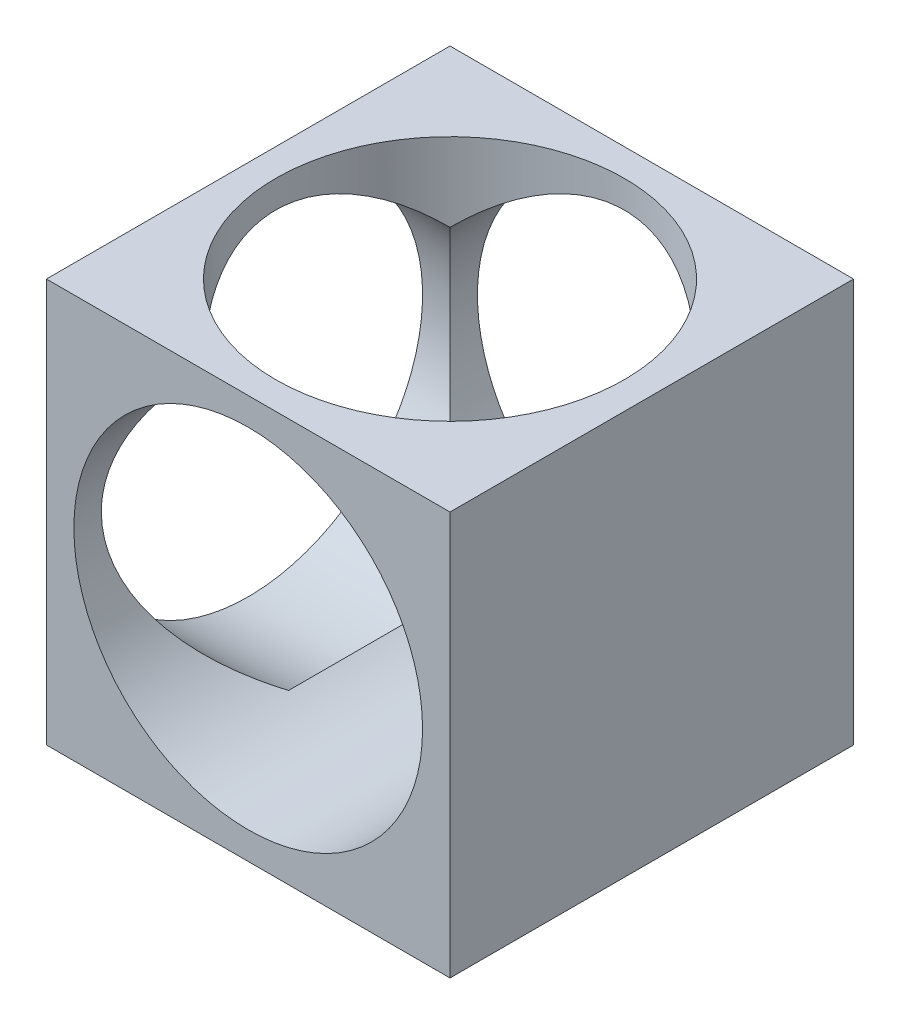
ISO-10303-21;
HEADER;
FILE_DESCRIPTION(('STEP AP214'),'2;1');
FILE_NAME('part.step','',(''),(''),'','','');
FILE_SCHEMA(('AUTOMOTIVE_DESIGN { 1 0 10303 214 1 1 1 1 }'));
ENDSEC;
DATA;
#1=APPLICATION_CONTEXT('core data for automotive mechanical design processes');
#2=APPLICATION_PROTOCOL_DEFINITION('international standard','automotive_design',2000,#1);
#3=PRODUCT_CONTEXT('',#1,'mechanical');
#4=PRODUCT('Part','Part','',(#3));
#5=PRODUCT_RELATED_PRODUCT_CATEGORY('part','',(#4));
#6=PRODUCT_DEFINITION_FORMATION('','',#4);
#7=PRODUCT_DEFINITION_CONTEXT('part definition',#1,'design');
#8=PRODUCT_DEFINITION('design','',#6,#7);
#9=PRODUCT_DEFINITION_SHAPE('','',#8);
#10=(LENGTH_UNIT() NAMED_UNIT(*) SI_UNIT(.MILLI.,.METRE.));
#11=(NAMED_UNIT(*) PLANE_ANGLE_UNIT() SI_UNIT($,.RADIAN.));
#12=(NAMED_UNIT(*) SI_UNIT($,.STERADIAN.) SOLID_ANGLE_UNIT());
#13=UNCERTAINTY_MEASURE_WITH_UNIT(LENGTH_MEASURE(1.E-05),#10,'distance_accuracy_value','');
#14=(GEOMETRIC_REPRESENTATION_CONTEXT(3) GLOBAL_UNCERTAINTY_ASSIGNED_CONTEXT((#13)) GLOBAL_UNIT_ASSIGNED_CONTEXT((#10,
#11,#12)) REPRESENTATION_CONTEXT('',''));
#15=CARTESIAN_POINT('',(0.,0.,0.));
#16=DIRECTION('',(0.,0.,1.));
#17=DIRECTION('',(1.,0.,0.));
#18=AXIS2_PLACEMENT_3D('',#15,#16,#17);
#19=CARTESIAN_POINT('',(0.,15.875,-15.875));
#20=DIRECTION('',(0.,0.,1.));
#21=DIRECTION('',(1.,0.,0.));
#22=AXIS2_PLACEMENT_3D('',#19,#20,#21);
#23=CYLINDRICAL_SURFACE('',#22,13.716);
#24=CARTESIAN_POINT('',(0.,15.875,15.875));
#25=DIRECTION('',(0.,0.,-1.));
#26=DIRECTION('',(-1.,0.,0.));
#27=AXIS2_PLACEMENT_3D('',#24,#25,#26);
#28=CIRCLE('',#27,13.716);
#29=CARTESIAN_POINT('',(-13.716,15.875,15.875));
#30=VERTEX_POINT('',#29);
#31=EDGE_CURVE('E138',#30,#30,#28,.T.);
#32=ORIENTED_EDGE('',*,*,#31,.F.);
#33=EDGE_LOOP('',(#32));
#34=FACE_BOUND('',#33,.T.);
#35=CARTESIAN_POINT('',(0.,15.875,-15.875));
#36=DIRECTION('',(0.,0.,1.));
#37=DIRECTION('',(1.,0.,0.));
#38=AXIS2_PLACEMENT_3D('',#35,#36,#37);
#39=CIRCLE('',#38,13.716);
#40=CARTESIAN_POINT('',(13.716,15.875,-15.875));
#41=VERTEX_POINT('',#40);
#42=EDGE_CURVE('E131',#41,#41,#39,.T.);
#43=ORIENTED_EDGE('',*,*,#42,.F.);
#44=EDGE_LOOP('',(#43));
#45=FACE_BOUND('',#44,.T.);
#46=DIRECTION('',(0.,0.,1.));
#47=VECTOR('',#46,1.);
#48=CARTESIAN_POINT('',(10.9537039854106,24.13,-15.875));
#49=LINE('',#48,#47);
#50=CARTESIAN_POINT('',(10.9537039854106,24.13,-8.255));
#51=VERTEX_POINT('',#50);
#52=CARTESIAN_POINT('',(10.9537039854106,24.13,8.255));
#53=VERTEX_POINT('',#52);
#54=EDGE_CURVE('E11',#51,#53,#49,.T.);
#55=ORIENTED_EDGE('',*,*,#54,.F.);
#56=CARTESIAN_POINT('',(0.,15.875,0.));
#57=DIRECTION('',(0.,0.707106781186547,0.707106781186547));
#58=DIRECTION('',(0.,-0.707106781186547,0.707106781186547));
#59=AXIS2_PLACEMENT_3D('',#56,#57,#58);
#60=ELLIPSE('',#59,19.3973532215094,13.716);
#61=CARTESIAN_POINT('',(-9.69867661075469,25.5736766107547,-9.69867661075468));
#62=VERTEX_POINT('',#61);
#63=EDGE_CURVE('E113',#51,#62,#60,.T.);
#64=ORIENTED_EDGE('',*,*,#63,.T.);
#65=CARTESIAN_POINT('',(0.,15.875,0.));
#66=DIRECTION('',(-0.707106781186547,0.,0.707106781186548));
#67=DIRECTION('',(0.707106781186547,0.,0.707106781186548));
#68=AXIS2_PLACEMENT_3D('',#65,#66,#67);
#69=ELLIPSE('',#68,19.3973532215094,13.716);
#70=CARTESIAN_POINT('',(-6.35,3.71744448912529,-6.35));
#71=VERTEX_POINT('',#70);
#72=EDGE_CURVE('E179',#62,#71,#69,.T.);
#73=ORIENTED_EDGE('',*,*,#72,.T.);
#74=DIRECTION('',(0.,0.,1.));
#75=VECTOR('',#74,1.);
#76=CARTESIAN_POINT('',(-6.35,3.71744448912529,-15.875));
#77=LINE('',#76,#75);
#78=CARTESIAN_POINT('',(-6.35,3.71744448912529,6.35));
#79=VERTEX_POINT('',#78);
#80=EDGE_CURVE('E182',#79,#71,#77,.F.);
#81=ORIENTED_EDGE('',*,*,#80,.F.);
#82=CARTESIAN_POINT('',(0.,15.875,0.));
#83=DIRECTION('',(0.707106781186547,0.,0.707106781186548));
#84=DIRECTION('',(-0.707106781186547,0.,0.707106781186548));
#85=AXIS2_PLACEMENT_3D('',#82,#83,#84);
#86=ELLIPSE('',#85,19.3973532215094,13.716);
#87=CARTESIAN_POINT('',(-9.69867661075469,25.5736766107547,9.69867661075469));
#88=VERTEX_POINT('',#87);
#89=EDGE_CURVE('E119',#79,#88,#86,.F.);
#90=ORIENTED_EDGE('',*,*,#89,.T.);
#91=CARTESIAN_POINT('',(0.,15.875,0.));
#92=DIRECTION('',(0.,-0.707106781186547,0.707106781186547));
#93=DIRECTION('',(0.,0.707106781186547,0.707106781186547));
#94=AXIS2_PLACEMENT_3D('',#91,#92,#93);
#95=ELLIPSE('',#94,19.3973532215094,13.716);
#96=EDGE_CURVE('E54',#88,#53,#95,.F.);
#97=ORIENTED_EDGE('',*,*,#96,.T.);
#98=EDGE_LOOP('',(#55,#64,#73,#81,#90,#97));
#99=FACE_BOUND('',#98,.T.);
#100=ADVANCED_FACE('F38',(#34,#45,#99),#23,.F.);
#101=CARTESIAN_POINT('',(15.875,31.75,15.875));
#102=DIRECTION('',(-1.,0.,0.));
#103=DIRECTION('',(0.,0.,1.));
#104=AXIS2_PLACEMENT_3D('',#101,#102,#103);
#105=PLANE('',#104);
#106=DIRECTION('',(0.,0.,-1.));
#107=VECTOR('',#106,1.);
#108=CARTESIAN_POINT('',(15.875,0.,15.875));
#109=LINE('',#108,#107);
#110=CARTESIAN_POINT('',(15.875,0.,15.875));
#111=VERTEX_POINT('',#110);
#112=CARTESIAN_POINT('',(15.875,0.,-15.875));
#113=VERTEX_POINT('',#112);
#114=EDGE_CURVE('E150',#111,#113,#109,.T.);
#115=ORIENTED_EDGE('',*,*,#114,.T.);
#116=DIRECTION('',(0.,-1.,0.));
#117=VECTOR('',#116,1.);
#118=CARTESIAN_POINT('',(15.875,31.75,-15.875));
#119=LINE('',#118,#117);
#120=CARTESIAN_POINT('',(15.875,31.75,-15.875));
#121=VERTEX_POINT('',#120);
#122=EDGE_CURVE('E171',#121,#113,#119,.T.);
#123=ORIENTED_EDGE('',*,*,#122,.F.);
#124=DIRECTION('',(0.,0.,-1.));
#125=VECTOR('',#124,1.);
#126=CARTESIAN_POINT('',(15.875,31.75,15.875));
#127=LINE('',#126,#125);
#128=CARTESIAN_POINT('',(15.875,31.75,15.875));
#129=VERTEX_POINT('',#128);
#130=EDGE_CURVE('E139',#129,#121,#127,.T.);
#131=ORIENTED_EDGE('',*,*,#130,.F.);
#132=DIRECTION('',(0.,-1.,0.));
#133=VECTOR('',#132,1.);
#134=CARTESIAN_POINT('',(15.875,31.75,15.875));
#135=LINE('',#134,#133);
#136=EDGE_CURVE('E149',#129,#111,#135,.T.);
#137=ORIENTED_EDGE('',*,*,#136,.T.);
#138=EDGE_LOOP('',(#115,#123,#131,#137));
#139=FACE_BOUND('',#138,.T.);
#140=ADVANCED_FACE('F40',(#139),#105,.F.);
#141=CARTESIAN_POINT('',(-15.875,31.75,-15.875));
#142=DIRECTION('',(0.,0.,1.));
#143=DIRECTION('',(1.,0.,0.));
#144=AXIS2_PLACEMENT_3D('',#141,#142,#143);
#145=PLANE('',#144);
#146=ORIENTED_EDGE('',*,*,#42,.T.);
#147=EDGE_LOOP('',(#146));
#148=FACE_BOUND('',#147,.T.);
#149=DIRECTION('',(-1.,0.,0.));
#150=VECTOR('',#149,1.);
#151=CARTESIAN_POINT('',(-15.875,0.,-15.875));
#152=LINE('',#151,#150);
#153=CARTESIAN_POINT('',(-15.875,0.,-15.875));
#154=VERTEX_POINT('',#153);
#155=EDGE_CURVE('E154',#113,#154,#152,.T.);
#156=ORIENTED_EDGE('',*,*,#155,.T.);
#157=DIRECTION('',(0.,-1.,0.));
#158=VECTOR('',#157,1.);
#159=CARTESIAN_POINT('',(-15.875,31.75,-15.875));
#160=LINE('',#159,#158);
#161=CARTESIAN_POINT('',(-15.875,31.75,-15.875));
#162=VERTEX_POINT('',#161);
#163=EDGE_CURVE('E167',#162,#154,#160,.T.);
#164=ORIENTED_EDGE('',*,*,#163,.F.);
#165=DIRECTION('',(-1.,0.,0.));
#166=VECTOR('',#165,1.);
#167=CARTESIAN_POINT('',(-15.875,31.75,-15.875));
#168=LINE('',#167,#166);
#169=EDGE_CURVE('E92',#121,#162,#168,.T.);
#170=ORIENTED_EDGE('',*,*,#169,.F.);
#171=ORIENTED_EDGE('',*,*,#122,.T.);
#172=EDGE_LOOP('',(#156,#164,#170,#171));
#173=FACE_BOUND('',#172,.T.);
#174=ADVANCED_FACE('F211',(#148,#173),#145,.F.);
#175=CARTESIAN_POINT('',(-15.875,31.75,15.875));
#176=DIRECTION('',(1.,0.,0.));
#177=DIRECTION('',(0.,0.,-1.));
#178=AXIS2_PLACEMENT_3D('',#175,#176,#177);
#179=PLANE('',#178);
#180=CARTESIAN_POINT('',(-15.875,15.875,0.));
#181=DIRECTION('',(-1.,0.,0.));
#182=DIRECTION('',(0.,0.,1.));
#183=AXIS2_PLACEMENT_3D('',#180,#181,#182);
#184=CIRCLE('',#183,13.716);
#185=CARTESIAN_POINT('',(-15.875,15.875,13.716));
#186=VERTEX_POINT('',#185);
#187=EDGE_CURVE('E123',#186,#186,#184,.T.);
#188=ORIENTED_EDGE('',*,*,#187,.F.);
#189=EDGE_LOOP('',(#188));
#190=FACE_BOUND('',#189,.T.);
#191=DIRECTION('',(0.,0.,1.));
#192=VECTOR('',#191,1.);
#193=CARTESIAN_POINT('',(-15.875,0.,15.875));
#194=LINE('',#193,#192);
#195=CARTESIAN_POINT('',(-15.875,0.,15.875));
#196=VERTEX_POINT('',#195);
#197=EDGE_CURVE('E157',#154,#196,#194,.T.);
#198=ORIENTED_EDGE('',*,*,#197,.T.);
#199=DIRECTION('',(0.,-1.,0.));
#200=VECTOR('',#199,1.);
#201=CARTESIAN_POINT('',(-15.875,31.75,15.875));
#202=LINE('',#201,#200);
#203=CARTESIAN_POINT('',(-15.875,31.75,15.875));
#204=VERTEX_POINT('',#203);
#205=EDGE_CURVE('E164',#204,#196,#202,.T.);
#206=ORIENTED_EDGE('',*,*,#205,.F.);
#207=DIRECTION('',(0.,0.,1.));
#208=VECTOR('',#207,1.);
#209=CARTESIAN_POINT('',(-15.875,31.75,15.875));
#210=LINE('',#209,#208);
#211=EDGE_CURVE('E144',#162,#204,#210,.T.);
#212=ORIENTED_EDGE('',*,*,#211,.F.);
#213=ORIENTED_EDGE('',*,*,#163,.T.);
#214=EDGE_LOOP('',(#198,#206,#212,#213));
#215=FACE_BOUND('',#214,.T.);
#216=ADVANCED_FACE('F225',(#190,#215),#179,.F.);
#217=CARTESIAN_POINT('',(-15.875,31.75,15.875));
#218=DIRECTION('',(0.,0.,-1.));
#219=DIRECTION('',(-1.,0.,0.));
#220=AXIS2_PLACEMENT_3D('',#217,#218,#219);
#221=PLANE('',#220);
#222=ORIENTED_EDGE('',*,*,#31,.T.);
#223=EDGE_LOOP('',(#222));
#224=FACE_BOUND('',#223,.T.);
#225=DIRECTION('',(1.,0.,0.));
#226=VECTOR('',#225,1.);
#227=CARTESIAN_POINT('',(-15.875,0.,15.875));
#228=LINE('',#227,#226);
#229=EDGE_CURVE('E84',#196,#111,#228,.T.);
#230=ORIENTED_EDGE('',*,*,#229,.T.);
#231=ORIENTED_EDGE('',*,*,#136,.F.);
#232=DIRECTION('',(1.,0.,0.));
#233=VECTOR('',#232,1.);
#234=CARTESIAN_POINT('',(-15.875,31.75,15.875));
#235=LINE('',#234,#233);
#236=EDGE_CURVE('E63',#204,#129,#235,.T.);
#237=ORIENTED_EDGE('',*,*,#236,.F.);
#238=ORIENTED_EDGE('',*,*,#205,.T.);
#239=EDGE_LOOP('',(#230,#231,#237,#238));
#240=FACE_BOUND('',#239,.T.);
#241=ADVANCED_FACE('F218',(#224,#240),#221,.F.);
#242=CARTESIAN_POINT('',(0.,31.75,0.));
#243=DIRECTION('',(0.,-1.,0.));
#244=DIRECTION('',(0.,0.,-1.));
#245=AXIS2_PLACEMENT_3D('',#242,#243,#244);
#246=PLANE('',#245);
#247=CARTESIAN_POINT('',(0.,31.75,0.));
#248=DIRECTION('',(0.,1.,0.));
#249=DIRECTION('',(0.,0.,1.));
#250=AXIS2_PLACEMENT_3D('',#247,#248,#249);
#251=CIRCLE('',#250,13.716);
#252=CARTESIAN_POINT('',(0.,31.75,13.716));
#253=VERTEX_POINT('',#252);
#254=EDGE_CURVE('E115',#253,#253,#251,.T.);
#255=ORIENTED_EDGE('',*,*,#254,.F.);
#256=EDGE_LOOP('',(#255));
#257=FACE_BOUND('',#256,.T.);
#258=ORIENTED_EDGE('',*,*,#130,.T.);
#259=ORIENTED_EDGE('',*,*,#169,.T.);
#260=ORIENTED_EDGE('',*,*,#211,.T.);
#261=ORIENTED_EDGE('',*,*,#236,.T.);
#262=EDGE_LOOP('',(#258,#259,#260,#261));
#263=FACE_BOUND('',#262,.T.);
#264=ADVANCED_FACE('F216',(#257,#263),#246,.F.);
#265=CARTESIAN_POINT('',(0.,0.,0.));
#266=DIRECTION('',(0.,-1.,0.));
#267=DIRECTION('',(0.,0.,-1.));
#268=AXIS2_PLACEMENT_3D('',#265,#266,#267);
#269=PLANE('',#268);
#270=ORIENTED_EDGE('',*,*,#114,.F.);
#271=ORIENTED_EDGE('',*,*,#229,.F.);
#272=ORIENTED_EDGE('',*,*,#197,.F.);
#273=ORIENTED_EDGE('',*,*,#155,.F.);
#274=EDGE_LOOP('',(#270,#271,#272,#273));
#275=FACE_BOUND('',#274,.T.);
#276=ADVANCED_FACE('F200',(#275),#269,.T.);
#277=CARTESIAN_POINT('',(-6.35,15.875,0.));
#278=DIRECTION('',(-1.,0.,0.));
#279=DIRECTION('',(0.,0.,1.));
#280=AXIS2_PLACEMENT_3D('',#277,#278,#279);
#281=CYLINDRICAL_SURFACE('',#280,13.716);
#282=ORIENTED_EDGE('',*,*,#187,.T.);
#283=EDGE_LOOP('',(#282));
#284=FACE_BOUND('',#283,.T.);
#285=ORIENTED_EDGE('',*,*,#72,.F.);
#286=CARTESIAN_POINT('',(0.,15.875,0.));
#287=DIRECTION('',(-0.707106781186547,-0.707106781186548,0.));
#288=DIRECTION('',(-0.707106781186547,0.707106781186548,0.));
#289=AXIS2_PLACEMENT_3D('',#286,#287,#288);
#290=ELLIPSE('',#289,19.3973532215094,13.716);
#291=EDGE_CURVE('E47',#62,#88,#290,.F.);
#292=ORIENTED_EDGE('',*,*,#291,.T.);
#293=ORIENTED_EDGE('',*,*,#89,.F.);
#294=CARTESIAN_POINT('',(-6.35,15.875,0.));
#295=DIRECTION('',(-1.,0.,0.));
#296=DIRECTION('',(0.,0.,1.));
#297=AXIS2_PLACEMENT_3D('',#294,#295,#296);
#298=CIRCLE('',#297,13.716);
#299=EDGE_CURVE('E127',#71,#79,#298,.T.);
#300=ORIENTED_EDGE('',*,*,#299,.F.);
#301=EDGE_LOOP('',(#285,#292,#293,#300));
#302=FACE_BOUND('',#301,.T.);
#303=ADVANCED_FACE('F188',(#284,#302),#281,.F.);
#304=CARTESIAN_POINT('',(-6.35,15.875,0.));
#305=DIRECTION('',(-1.,0.,0.));
#306=DIRECTION('',(0.,0.,1.));
#307=AXIS2_PLACEMENT_3D('',#304,#305,#306);
#308=PLANE('',#307);
#309=ORIENTED_EDGE('',*,*,#80,.T.);
#310=ORIENTED_EDGE('',*,*,#299,.T.);
#311=EDGE_LOOP('',(#309,#310));
#312=FACE_BOUND('',#311,.T.);
#313=ADVANCED_FACE('F191',(#312),#308,.T.);
#314=CARTESIAN_POINT('',(0.,24.13,0.));
#315=DIRECTION('',(0.,1.,0.));
#316=DIRECTION('',(0.,0.,1.));
#317=AXIS2_PLACEMENT_3D('',#314,#315,#316);
#318=PLANE('',#317);
#319=ORIENTED_EDGE('',*,*,#54,.T.);
#320=CARTESIAN_POINT('',(0.,24.13,0.));
#321=DIRECTION('',(0.,1.,0.));
#322=DIRECTION('',(0.,0.,1.));
#323=AXIS2_PLACEMENT_3D('',#320,#321,#322);
#324=CIRCLE('',#323,13.716);
#325=EDGE_CURVE('E109',#53,#51,#324,.T.);
#326=ORIENTED_EDGE('',*,*,#325,.T.);
#327=EDGE_LOOP('',(#319,#326));
#328=FACE_BOUND('',#327,.T.);
#329=ADVANCED_FACE('F108',(#328),#318,.T.);
#330=CARTESIAN_POINT('',(0.,24.13,0.));
#331=DIRECTION('',(0.,1.,0.));
#332=DIRECTION('',(0.,0.,1.));
#333=AXIS2_PLACEMENT_3D('',#330,#331,#332);
#334=CYLINDRICAL_SURFACE('',#333,13.716);
#335=ORIENTED_EDGE('',*,*,#254,.T.);
#336=EDGE_LOOP('',(#335));
#337=FACE_BOUND('',#336,.T.);
#338=ORIENTED_EDGE('',*,*,#325,.F.);
#339=ORIENTED_EDGE('',*,*,#96,.F.);
#340=ORIENTED_EDGE('',*,*,#291,.F.);
#341=ORIENTED_EDGE('',*,*,#63,.F.);
#342=EDGE_LOOP('',(#338,#339,#340,#341));
#343=FACE_BOUND('',#342,.T.);
#344=ADVANCED_FACE('F112',(#337,#343),#334,.F.);
#345=CLOSED_SHELL('',(#100,#140,#174,#216,#241,#264,#276,#303,#313,#329,#344));
#346=MANIFOLD_SOLID_BREP('B2',#345);
#347=ADVANCED_BREP_SHAPE_REPRESENTATION('',(#18,#346),#14);
#348=SHAPE_DEFINITION_REPRESENTATION(#9,#347);
ENDSEC;
END-ISO-10303-21;
